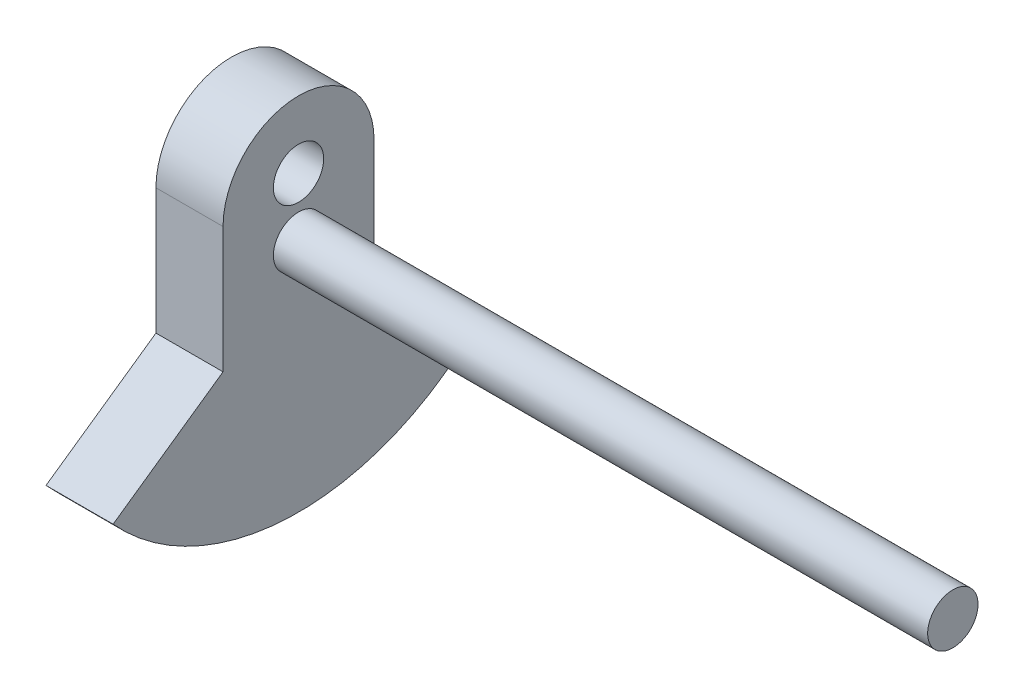
ISO-10303-21;
HEADER;
FILE_DESCRIPTION(('STEP AP214'),'2;1');
FILE_NAME('part.step','',(''),(''),'','','');
FILE_SCHEMA(('AUTOMOTIVE_DESIGN { 1 0 10303 214 1 1 1 1 }'));
ENDSEC;
DATA;
#1=APPLICATION_CONTEXT('core data for automotive mechanical design processes');
#2=APPLICATION_PROTOCOL_DEFINITION('international standard','automotive_design',2000,#1);
#3=PRODUCT_CONTEXT('',#1,'mechanical');
#4=PRODUCT('Part','Part','',(#3));
#5=PRODUCT_RELATED_PRODUCT_CATEGORY('part','',(#4));
#6=PRODUCT_DEFINITION_FORMATION('','',#4);
#7=PRODUCT_DEFINITION_CONTEXT('part definition',#1,'design');
#8=PRODUCT_DEFINITION('design','',#6,#7);
#9=PRODUCT_DEFINITION_SHAPE('','',#8);
#10=(LENGTH_UNIT() NAMED_UNIT(*) SI_UNIT(.MILLI.,.METRE.));
#11=(NAMED_UNIT(*) PLANE_ANGLE_UNIT() SI_UNIT($,.RADIAN.));
#12=(NAMED_UNIT(*) SI_UNIT($,.STERADIAN.) SOLID_ANGLE_UNIT());
#13=UNCERTAINTY_MEASURE_WITH_UNIT(LENGTH_MEASURE(1.E-05),#10,'distance_accuracy_value','');
#14=(GEOMETRIC_REPRESENTATION_CONTEXT(3) GLOBAL_UNCERTAINTY_ASSIGNED_CONTEXT((#13)) GLOBAL_UNIT_ASSIGNED_CONTEXT((#10,
#11,#12)) REPRESENTATION_CONTEXT('',''));
#15=CARTESIAN_POINT('',(0.,0.,0.));
#16=DIRECTION('',(0.,0.,1.));
#17=DIRECTION('',(1.,0.,0.));
#18=AXIS2_PLACEMENT_3D('',#15,#16,#17);
#19=CARTESIAN_POINT('',(4.,0.89347957198437,0.));
#20=DIRECTION('',(1.,0.,0.));
#21=DIRECTION('',(0.,0.,-1.));
#22=AXIS2_PLACEMENT_3D('',#19,#20,#21);
#23=PLANE('',#22);
#24=CARTESIAN_POINT('',(4.,3.5,0.));
#25=DIRECTION('',(1.,0.,0.));
#26=DIRECTION('',(0.,0.,-1.));
#27=AXIS2_PLACEMENT_3D('',#24,#25,#26);
#28=CIRCLE('',#27,1.5);
#29=CARTESIAN_POINT('',(4.,3.5,-1.5));
#30=VERTEX_POINT('',#29);
#31=EDGE_CURVE('E175',#30,#30,#28,.F.);
#32=ORIENTED_EDGE('',*,*,#31,.T.);
#33=EDGE_LOOP('',(#32));
#34=FACE_BOUND('',#33,.T.);
#35=CARTESIAN_POINT('',(4.,0.89347957198437,0.));
#36=DIRECTION('',(1.,0.,0.));
#37=DIRECTION('',(0.,0.,-1.));
#38=AXIS2_PLACEMENT_3D('',#35,#36,#37);
#39=CIRCLE('',#38,14.8934795719844);
#40=CARTESIAN_POINT('',(4.,-9.08861149080841,11.0532163543119));
#41=VERTEX_POINT('',#40);
#42=CARTESIAN_POINT('',(4.,-9.0886114908084,-11.0532163543119));
#43=VERTEX_POINT('',#42);
#44=EDGE_CURVE('E130',#41,#43,#39,.T.);
#45=ORIENTED_EDGE('',*,*,#44,.T.);
#46=DIRECTION('',(0.,0.57357643635105,0.819152044288989));
#47=VECTOR('',#46,1.);
#48=CARTESIAN_POINT('',(4.,-4.5,-4.5));
#49=LINE('',#48,#47);
#50=CARTESIAN_POINT('',(4.,-4.5,-4.5));
#51=VERTEX_POINT('',#50);
#52=EDGE_CURVE('E88',#43,#51,#49,.T.);
#53=ORIENTED_EDGE('',*,*,#52,.T.);
#54=DIRECTION('',(0.,1.,0.));
#55=VECTOR('',#54,1.);
#56=CARTESIAN_POINT('',(4.,-4.5,-4.5));
#57=LINE('',#56,#55);
#58=CARTESIAN_POINT('',(4.,3.,-4.5));
#59=VERTEX_POINT('',#58);
#60=EDGE_CURVE('E101',#51,#59,#57,.T.);
#61=ORIENTED_EDGE('',*,*,#60,.T.);
#62=CARTESIAN_POINT('',(4.,3.,0.));
#63=DIRECTION('',(1.,0.,0.));
#64=DIRECTION('',(0.,0.,1.));
#65=AXIS2_PLACEMENT_3D('',#62,#63,#64);
#66=CIRCLE('',#65,4.5);
#67=CARTESIAN_POINT('',(4.,3.,4.5));
#68=VERTEX_POINT('',#67);
#69=EDGE_CURVE('E95',#59,#68,#66,.T.);
#70=ORIENTED_EDGE('',*,*,#69,.T.);
#71=DIRECTION('',(0.,-1.,0.));
#72=VECTOR('',#71,1.);
#73=CARTESIAN_POINT('',(4.,-4.5,4.5));
#74=LINE('',#73,#72);
#75=CARTESIAN_POINT('',(4.,-4.5,4.5));
#76=VERTEX_POINT('',#75);
#77=EDGE_CURVE('E99',#68,#76,#74,.T.);
#78=ORIENTED_EDGE('',*,*,#77,.T.);
#79=DIRECTION('',(0.,-0.57357643635105,0.819152044288989));
#80=VECTOR('',#79,1.);
#81=CARTESIAN_POINT('',(4.,-4.5,4.5));
#82=LINE('',#81,#80);
#83=EDGE_CURVE('E51',#76,#41,#82,.T.);
#84=ORIENTED_EDGE('',*,*,#83,.T.);
#85=EDGE_LOOP('',(#45,#53,#61,#70,#78,#84));
#86=FACE_BOUND('',#85,.T.);
#87=CARTESIAN_POINT('',(4.,0.,0.));
#88=DIRECTION('',(1.,0.,0.));
#89=DIRECTION('',(0.,0.,-1.));
#90=AXIS2_PLACEMENT_3D('',#87,#88,#89);
#91=CIRCLE('',#90,1.5);
#92=CARTESIAN_POINT('',(4.,0.,-1.5));
#93=VERTEX_POINT('',#92);
#94=EDGE_CURVE('E123',#93,#93,#91,.T.);
#95=ORIENTED_EDGE('',*,*,#94,.F.);
#96=EDGE_LOOP('',(#95));
#97=FACE_BOUND('',#96,.T.);
#98=ADVANCED_FACE('F34',(#34,#86,#97),#23,.T.);
#99=CARTESIAN_POINT('',(0.,0.89347957198437,0.));
#100=DIRECTION('',(1.,0.,0.));
#101=DIRECTION('',(0.,0.,-1.));
#102=AXIS2_PLACEMENT_3D('',#99,#100,#101);
#103=PLANE('',#102);
#104=CARTESIAN_POINT('',(0.,3.5,0.));
#105=DIRECTION('',(-1.,0.,0.));
#106=DIRECTION('',(0.,0.,1.));
#107=AXIS2_PLACEMENT_3D('',#104,#105,#106);
#108=CIRCLE('',#107,1.5);
#109=CARTESIAN_POINT('',(0.,3.5,1.5));
#110=VERTEX_POINT('',#109);
#111=EDGE_CURVE('E178',#110,#110,#108,.T.);
#112=ORIENTED_EDGE('',*,*,#111,.F.);
#113=EDGE_LOOP('',(#112));
#114=FACE_BOUND('',#113,.T.);
#115=CARTESIAN_POINT('',(0.,0.89347957198437,0.));
#116=DIRECTION('',(1.,0.,0.));
#117=DIRECTION('',(0.,0.,-1.));
#118=AXIS2_PLACEMENT_3D('',#115,#116,#117);
#119=CIRCLE('',#118,14.8934795719844);
#120=CARTESIAN_POINT('',(0.,-9.08861149080841,11.0532163543119));
#121=VERTEX_POINT('',#120);
#122=CARTESIAN_POINT('',(0.,-9.0886114908084,-11.0532163543119));
#123=VERTEX_POINT('',#122);
#124=EDGE_CURVE('E119',#121,#123,#119,.T.);
#125=ORIENTED_EDGE('',*,*,#124,.F.);
#126=DIRECTION('',(0.,-0.57357643635105,0.819152044288989));
#127=VECTOR('',#126,1.);
#128=CARTESIAN_POINT('',(0.,-4.5,4.5));
#129=LINE('',#128,#127);
#130=CARTESIAN_POINT('',(0.,-4.5,4.5));
#131=VERTEX_POINT('',#130);
#132=EDGE_CURVE('E80',#131,#121,#129,.T.);
#133=ORIENTED_EDGE('',*,*,#132,.F.);
#134=DIRECTION('',(0.,-1.,0.));
#135=VECTOR('',#134,1.);
#136=CARTESIAN_POINT('',(0.,-4.5,4.5));
#137=LINE('',#136,#135);
#138=CARTESIAN_POINT('',(0.,3.,4.5));
#139=VERTEX_POINT('',#138);
#140=EDGE_CURVE('E74',#139,#131,#137,.T.);
#141=ORIENTED_EDGE('',*,*,#140,.F.);
#142=CARTESIAN_POINT('',(0.,3.,0.));
#143=DIRECTION('',(1.,0.,0.));
#144=DIRECTION('',(0.,0.,1.));
#145=AXIS2_PLACEMENT_3D('',#142,#143,#144);
#146=CIRCLE('',#145,4.5);
#147=CARTESIAN_POINT('',(0.,3.,-4.5));
#148=VERTEX_POINT('',#147);
#149=EDGE_CURVE('E109',#148,#139,#146,.T.);
#150=ORIENTED_EDGE('',*,*,#149,.F.);
#151=DIRECTION('',(0.,1.,0.));
#152=VECTOR('',#151,1.);
#153=CARTESIAN_POINT('',(0.,-4.5,-4.5));
#154=LINE('',#153,#152);
#155=CARTESIAN_POINT('',(0.,-4.5,-4.5));
#156=VERTEX_POINT('',#155);
#157=EDGE_CURVE('E125',#156,#148,#154,.T.);
#158=ORIENTED_EDGE('',*,*,#157,.F.);
#159=DIRECTION('',(0.,0.57357643635105,0.819152044288989));
#160=VECTOR('',#159,1.);
#161=CARTESIAN_POINT('',(0.,-4.5,-4.5));
#162=LINE('',#161,#160);
#163=EDGE_CURVE('E122',#123,#156,#162,.T.);
#164=ORIENTED_EDGE('',*,*,#163,.F.);
#165=EDGE_LOOP('',(#125,#133,#141,#150,#158,#164));
#166=FACE_BOUND('',#165,.T.);
#167=ADVANCED_FACE('F139',(#114,#166),#103,.F.);
#168=CARTESIAN_POINT('',(4.,0.89347957198437,0.));
#169=DIRECTION('',(-1.,0.,0.));
#170=DIRECTION('',(0.,0.,1.));
#171=AXIS2_PLACEMENT_3D('',#168,#169,#170);
#172=CYLINDRICAL_SURFACE('',#171,14.8934795719844);
#173=ORIENTED_EDGE('',*,*,#124,.T.);
#174=DIRECTION('',(-1.,0.,0.));
#175=VECTOR('',#174,1.);
#176=CARTESIAN_POINT('',(4.,-9.0886114908084,-11.0532163543119));
#177=LINE('',#176,#175);
#178=EDGE_CURVE('E11',#43,#123,#177,.T.);
#179=ORIENTED_EDGE('',*,*,#178,.F.);
#180=ORIENTED_EDGE('',*,*,#44,.F.);
#181=DIRECTION('',(-1.,0.,0.));
#182=VECTOR('',#181,1.);
#183=CARTESIAN_POINT('',(4.,-9.08861149080841,11.0532163543119));
#184=LINE('',#183,#182);
#185=EDGE_CURVE('E115',#41,#121,#184,.T.);
#186=ORIENTED_EDGE('',*,*,#185,.T.);
#187=EDGE_LOOP('',(#173,#179,#180,#186));
#188=FACE_BOUND('',#187,.T.);
#189=ADVANCED_FACE('F36',(#188),#172,.T.);
#190=CARTESIAN_POINT('',(4.,-4.5,-4.5));
#191=DIRECTION('',(0.,-0.819152044288989,0.57357643635105));
#192=DIRECTION('',(0.,-0.57357643635105,-0.819152044288989));
#193=AXIS2_PLACEMENT_3D('',#190,#191,#192);
#194=PLANE('',#193);
#195=ORIENTED_EDGE('',*,*,#163,.T.);
#196=DIRECTION('',(-1.,0.,0.));
#197=VECTOR('',#196,1.);
#198=CARTESIAN_POINT('',(4.,-4.5,-4.5));
#199=LINE('',#198,#197);
#200=EDGE_CURVE('E43',#51,#156,#199,.T.);
#201=ORIENTED_EDGE('',*,*,#200,.F.);
#202=ORIENTED_EDGE('',*,*,#52,.F.);
#203=ORIENTED_EDGE('',*,*,#178,.T.);
#204=EDGE_LOOP('',(#195,#201,#202,#203));
#205=FACE_BOUND('',#204,.T.);
#206=ADVANCED_FACE('F228',(#205),#194,.F.);
#207=CARTESIAN_POINT('',(4.,-4.5,-4.5));
#208=DIRECTION('',(0.,0.,1.));
#209=DIRECTION('',(0.,-1.,0.));
#210=AXIS2_PLACEMENT_3D('',#207,#208,#209);
#211=PLANE('',#210);
#212=ORIENTED_EDGE('',*,*,#157,.T.);
#213=DIRECTION('',(-1.,0.,0.));
#214=VECTOR('',#213,1.);
#215=CARTESIAN_POINT('',(4.,3.,-4.5));
#216=LINE('',#215,#214);
#217=EDGE_CURVE('E110',#59,#148,#216,.T.);
#218=ORIENTED_EDGE('',*,*,#217,.F.);
#219=ORIENTED_EDGE('',*,*,#60,.F.);
#220=ORIENTED_EDGE('',*,*,#200,.T.);
#221=EDGE_LOOP('',(#212,#218,#219,#220));
#222=FACE_BOUND('',#221,.T.);
#223=ADVANCED_FACE('F136',(#222),#211,.F.);
#224=CARTESIAN_POINT('',(4.,3.,0.));
#225=DIRECTION('',(-1.,0.,0.));
#226=DIRECTION('',(0.,0.,1.));
#227=AXIS2_PLACEMENT_3D('',#224,#225,#226);
#228=CYLINDRICAL_SURFACE('',#227,4.5);
#229=ORIENTED_EDGE('',*,*,#149,.T.);
#230=DIRECTION('',(-1.,0.,0.));
#231=VECTOR('',#230,1.);
#232=CARTESIAN_POINT('',(4.,3.,4.5));
#233=LINE('',#232,#231);
#234=EDGE_CURVE('E106',#68,#139,#233,.T.);
#235=ORIENTED_EDGE('',*,*,#234,.F.);
#236=ORIENTED_EDGE('',*,*,#69,.F.);
#237=ORIENTED_EDGE('',*,*,#217,.T.);
#238=EDGE_LOOP('',(#229,#235,#236,#237));
#239=FACE_BOUND('',#238,.T.);
#240=ADVANCED_FACE('F107',(#239),#228,.T.);
#241=CARTESIAN_POINT('',(4.,-4.5,4.5));
#242=DIRECTION('',(0.,0.,-1.));
#243=DIRECTION('',(0.,1.,0.));
#244=AXIS2_PLACEMENT_3D('',#241,#242,#243);
#245=PLANE('',#244);
#246=ORIENTED_EDGE('',*,*,#140,.T.);
#247=DIRECTION('',(-1.,0.,0.));
#248=VECTOR('',#247,1.);
#249=CARTESIAN_POINT('',(4.,-4.5,4.5));
#250=LINE('',#249,#248);
#251=EDGE_CURVE('E111',#76,#131,#250,.T.);
#252=ORIENTED_EDGE('',*,*,#251,.F.);
#253=ORIENTED_EDGE('',*,*,#77,.F.);
#254=ORIENTED_EDGE('',*,*,#234,.T.);
#255=EDGE_LOOP('',(#246,#252,#253,#254));
#256=FACE_BOUND('',#255,.T.);
#257=ADVANCED_FACE('F113',(#256),#245,.F.);
#258=CARTESIAN_POINT('',(4.,-4.5,4.5));
#259=DIRECTION('',(0.,-0.819152044288989,-0.57357643635105));
#260=DIRECTION('',(0.,0.57357643635105,-0.819152044288989));
#261=AXIS2_PLACEMENT_3D('',#258,#259,#260);
#262=PLANE('',#261);
#263=ORIENTED_EDGE('',*,*,#132,.T.);
#264=ORIENTED_EDGE('',*,*,#185,.F.);
#265=ORIENTED_EDGE('',*,*,#83,.F.);
#266=ORIENTED_EDGE('',*,*,#251,.T.);
#267=EDGE_LOOP('',(#263,#264,#265,#266));
#268=FACE_BOUND('',#267,.T.);
#269=ADVANCED_FACE('F143',(#268),#262,.F.);
#270=CARTESIAN_POINT('',(43.,0.,0.));
#271=DIRECTION('',(-1.,0.,0.));
#272=DIRECTION('',(0.,0.,1.));
#273=AXIS2_PLACEMENT_3D('',#270,#271,#272);
#274=CYLINDRICAL_SURFACE('',#273,1.5);
#275=ORIENTED_EDGE('',*,*,#94,.T.);
#276=EDGE_LOOP('',(#275));
#277=FACE_BOUND('',#276,.T.);
#278=CARTESIAN_POINT('',(43.,0.,0.));
#279=DIRECTION('',(1.,0.,0.));
#280=DIRECTION('',(0.,0.,-1.));
#281=AXIS2_PLACEMENT_3D('',#278,#279,#280);
#282=CIRCLE('',#281,1.5);
#283=CARTESIAN_POINT('',(43.,0.,-1.5));
#284=VERTEX_POINT('',#283);
#285=EDGE_CURVE('E179',#284,#284,#282,.T.);
#286=ORIENTED_EDGE('',*,*,#285,.F.);
#287=EDGE_LOOP('',(#286));
#288=FACE_BOUND('',#287,.T.);
#289=ADVANCED_FACE('F145',(#277,#288),#274,.T.);
#290=CARTESIAN_POINT('',(43.,-4.58121654747046,-23.2618423188195));
#291=DIRECTION('',(1.,0.,0.));
#292=DIRECTION('',(0.,0.,-1.));
#293=AXIS2_PLACEMENT_3D('',#290,#291,#292);
#294=PLANE('',#293);
#295=ORIENTED_EDGE('',*,*,#285,.T.);
#296=EDGE_LOOP('',(#295));
#297=FACE_BOUND('',#296,.T.);
#298=ADVANCED_FACE('F151',(#297),#294,.T.);
#299=CARTESIAN_POINT('',(43.001,3.5,0.));
#300=DIRECTION('',(-1.,0.,0.));
#301=DIRECTION('',(0.,0.,1.));
#302=AXIS2_PLACEMENT_3D('',#299,#300,#301);
#303=CYLINDRICAL_SURFACE('',#302,1.5);
#304=ORIENTED_EDGE('',*,*,#31,.F.);
#305=EDGE_LOOP('',(#304));
#306=FACE_BOUND('',#305,.T.);
#307=ORIENTED_EDGE('',*,*,#111,.T.);
#308=EDGE_LOOP('',(#307));
#309=FACE_BOUND('',#308,.T.);
#310=ADVANCED_FACE('F167',(#306,#309),#303,.F.);
#311=CLOSED_SHELL('',(#98,#167,#189,#206,#223,#240,#257,#269,#289,#298,#310));
#312=MANIFOLD_SOLID_BREP('B2',#311);
#313=ADVANCED_BREP_SHAPE_REPRESENTATION('',(#18,#312),#14);
#314=SHAPE_DEFINITION_REPRESENTATION(#9,#313);
ENDSEC;
END-ISO-10303-21;
